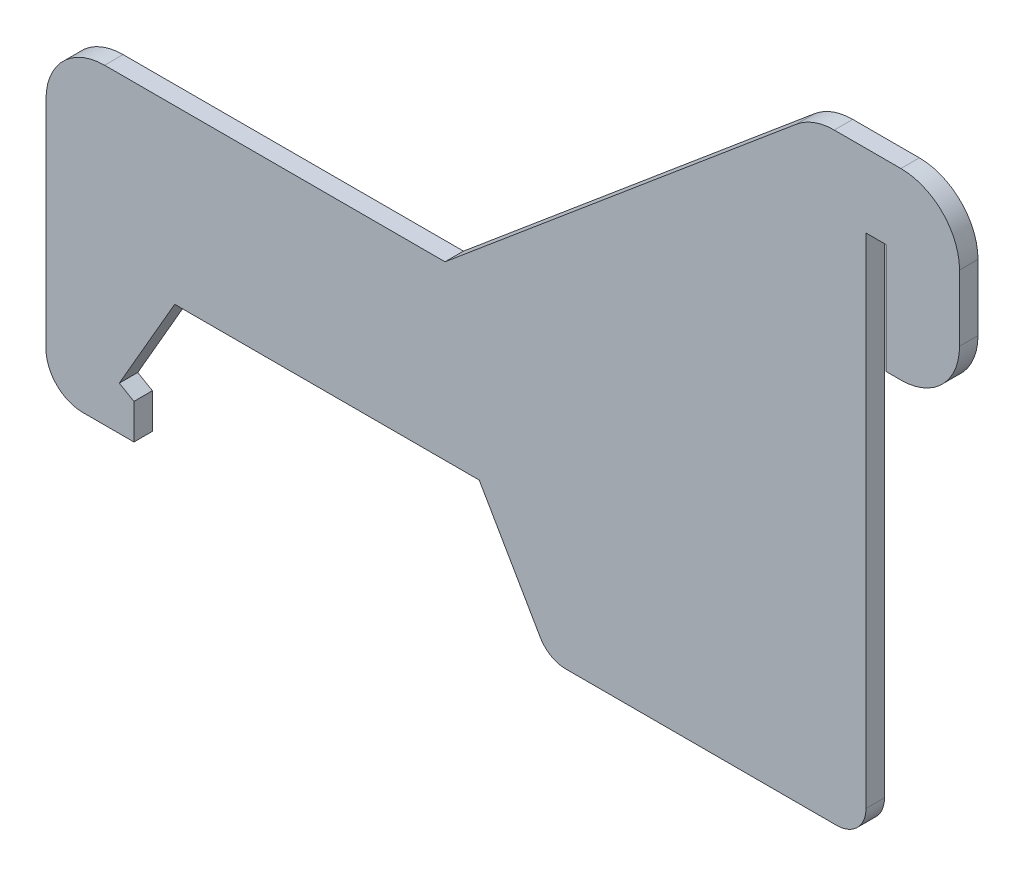
ISO-10303-21;
HEADER;
FILE_DESCRIPTION(('STEP AP214'),'2;1');
FILE_NAME('part.step','',(''),(''),'','','');
FILE_SCHEMA(('AUTOMOTIVE_DESIGN { 1 0 10303 214 1 1 1 1 }'));
ENDSEC;
DATA;
#1=APPLICATION_CONTEXT('core data for automotive mechanical design processes');
#2=APPLICATION_PROTOCOL_DEFINITION('international standard','automotive_design',2000,#1);
#3=PRODUCT_CONTEXT('',#1,'mechanical');
#4=PRODUCT('Part','Part','',(#3));
#5=PRODUCT_RELATED_PRODUCT_CATEGORY('part','',(#4));
#6=PRODUCT_DEFINITION_FORMATION('','',#4);
#7=PRODUCT_DEFINITION_CONTEXT('part definition',#1,'design');
#8=PRODUCT_DEFINITION('design','',#6,#7);
#9=PRODUCT_DEFINITION_SHAPE('','',#8);
#10=(LENGTH_UNIT() NAMED_UNIT(*) SI_UNIT(.MILLI.,.METRE.));
#11=(NAMED_UNIT(*) PLANE_ANGLE_UNIT() SI_UNIT($,.RADIAN.));
#12=(NAMED_UNIT(*) SI_UNIT($,.STERADIAN.) SOLID_ANGLE_UNIT());
#13=UNCERTAINTY_MEASURE_WITH_UNIT(LENGTH_MEASURE(1.E-05),#10,'distance_accuracy_value','');
#14=(GEOMETRIC_REPRESENTATION_CONTEXT(3) GLOBAL_UNCERTAINTY_ASSIGNED_CONTEXT((#13)) GLOBAL_UNIT_ASSIGNED_CONTEXT((#10,
#11,#12)) REPRESENTATION_CONTEXT('',''));
#15=CARTESIAN_POINT('',(0.,0.,0.));
#16=DIRECTION('',(0.,0.,1.));
#17=DIRECTION('',(1.,0.,0.));
#18=AXIS2_PLACEMENT_3D('',#15,#16,#17);
#19=CARTESIAN_POINT('',(21.9654534929176,10.4498181024498,0.8001));
#20=DIRECTION('',(0.,1.,0.));
#21=DIRECTION('',(-1.,0.,0.));
#22=AXIS2_PLACEMENT_3D('',#19,#20,#21);
#23=PLANE('',#22);
#24=DIRECTION('',(1.,0.,0.));
#25=VECTOR('',#24,1.);
#26=CARTESIAN_POINT('',(21.9654534929176,10.4498181024498,-0.8001));
#27=LINE('',#26,#25);
#28=CARTESIAN_POINT('',(-4.41849178405351,10.4498181024498,-0.8001));
#29=VERTEX_POINT('',#28);
#30=CARTESIAN_POINT('',(21.9654534929176,10.4498181024498,-0.8001));
#31=VERTEX_POINT('',#30);
#32=EDGE_CURVE('E217',#29,#31,#27,.T.);
#33=ORIENTED_EDGE('',*,*,#32,.T.);
#34=DIRECTION('',(0.,0.,-1.));
#35=VECTOR('',#34,1.);
#36=CARTESIAN_POINT('',(21.9654534929176,10.4498181024498,0.8001));
#37=LINE('',#36,#35);
#38=CARTESIAN_POINT('',(21.9654534929176,10.4498181024498,0.8001));
#39=VERTEX_POINT('',#38);
#40=EDGE_CURVE('E11',#39,#31,#37,.T.);
#41=ORIENTED_EDGE('',*,*,#40,.F.);
#42=DIRECTION('',(1.,0.,0.));
#43=VECTOR('',#42,1.);
#44=CARTESIAN_POINT('',(21.9654534929176,10.4498181024498,0.8001));
#45=LINE('',#44,#43);
#46=CARTESIAN_POINT('',(-4.41849178405351,10.4498181024498,0.8001));
#47=VERTEX_POINT('',#46);
#48=EDGE_CURVE('E261',#47,#39,#45,.T.);
#49=ORIENTED_EDGE('',*,*,#48,.F.);
#50=DIRECTION('',(0.,0.,-1.));
#51=VECTOR('',#50,1.);
#52=CARTESIAN_POINT('',(-4.41849178405351,10.4498181024498,0.8001));
#53=LINE('',#52,#51);
#54=EDGE_CURVE('E213',#47,#29,#53,.T.);
#55=ORIENTED_EDGE('',*,*,#54,.T.);
#56=EDGE_LOOP('',(#33,#41,#49,#55));
#57=FACE_BOUND('',#56,.T.);
#58=ADVANCED_FACE('F31',(#57),#23,.F.);
#59=CARTESIAN_POINT('',(27.2507592486414,1.29539999999989,0.8001));
#60=DIRECTION('',(0.866025403784438,0.5,0.));
#61=DIRECTION('',(-0.5,0.866025403784438,0.));
#62=AXIS2_PLACEMENT_3D('',#59,#60,#61);
#63=PLANE('',#62);
#64=DIRECTION('',(0.5,-0.866025403784438,0.));
#65=VECTOR('',#64,1.);
#66=CARTESIAN_POINT('',(27.2507592486414,1.29539999999989,-0.8001));
#67=LINE('',#66,#65);
#68=CARTESIAN_POINT('',(27.2507592486414,1.29539999999989,-0.8001));
#69=VERTEX_POINT('',#68);
#70=EDGE_CURVE('E220',#31,#69,#67,.T.);
#71=ORIENTED_EDGE('',*,*,#70,.T.);
#72=DIRECTION('',(0.,0.,-1.));
#73=VECTOR('',#72,1.);
#74=CARTESIAN_POINT('',(27.2507592486414,1.29539999999989,0.8001));
#75=LINE('',#74,#73);
#76=CARTESIAN_POINT('',(27.2507592486414,1.29539999999989,0.8001));
#77=VERTEX_POINT('',#76);
#78=EDGE_CURVE('E39',#77,#69,#75,.T.);
#79=ORIENTED_EDGE('',*,*,#78,.F.);
#80=DIRECTION('',(0.5,-0.866025403784438,0.));
#81=VECTOR('',#80,1.);
#82=CARTESIAN_POINT('',(27.2507592486414,1.29539999999989,0.8001));
#83=LINE('',#82,#81);
#84=EDGE_CURVE('E135',#39,#77,#83,.T.);
#85=ORIENTED_EDGE('',*,*,#84,.F.);
#86=ORIENTED_EDGE('',*,*,#40,.T.);
#87=EDGE_LOOP('',(#71,#79,#85,#86));
#88=FACE_BOUND('',#87,.T.);
#89=ADVANCED_FACE('F394',(#88),#63,.F.);
#90=CARTESIAN_POINT('',(29.4504637742539,2.56539999999989,0.8001));
#91=DIRECTION('',(0.,0.,-1.));
#92=DIRECTION('',(-1.,0.,0.));
#93=AXIS2_PLACEMENT_3D('',#90,#91,#92);
#94=CYLINDRICAL_SURFACE('',#93,2.54);
#95=CARTESIAN_POINT('',(29.4504637742539,2.56539999999989,-0.8001));
#96=DIRECTION('',(0.,0.,1.));
#97=DIRECTION('',(-1.,0.,0.));
#98=AXIS2_PLACEMENT_3D('',#95,#96,#97);
#99=CIRCLE('',#98,2.54);
#100=CARTESIAN_POINT('',(29.4504637742539,0.0253999999998938,-0.8001));
#101=VERTEX_POINT('',#100);
#102=EDGE_CURVE('E222',#69,#101,#99,.T.);
#103=ORIENTED_EDGE('',*,*,#102,.T.);
#104=DIRECTION('',(0.,0.,-1.));
#105=VECTOR('',#104,1.);
#106=CARTESIAN_POINT('',(29.4504637742539,0.0253999999998938,0.8001));
#107=LINE('',#106,#105);
#108=CARTESIAN_POINT('',(29.4504637742539,0.0253999999998938,0.8001));
#109=VERTEX_POINT('',#108);
#110=EDGE_CURVE('E313',#109,#101,#107,.T.);
#111=ORIENTED_EDGE('',*,*,#110,.F.);
#112=CARTESIAN_POINT('',(29.4504637742539,2.56539999999989,0.8001));
#113=DIRECTION('',(0.,0.,1.));
#114=DIRECTION('',(-1.,0.,0.));
#115=AXIS2_PLACEMENT_3D('',#112,#113,#114);
#116=CIRCLE('',#115,2.54);
#117=EDGE_CURVE('E321',#77,#109,#116,.T.);
#118=ORIENTED_EDGE('',*,*,#117,.F.);
#119=ORIENTED_EDGE('',*,*,#78,.T.);
#120=EDGE_LOOP('',(#103,#111,#118,#119));
#121=FACE_BOUND('',#120,.T.);
#122=ADVANCED_FACE('F319',(#121),#94,.T.);
#123=CARTESIAN_POINT('',(29.4504637742539,0.0253999999998917,0.8001));
#124=DIRECTION('',(0.,1.,0.));
#125=DIRECTION('',(0.,0.,1.));
#126=AXIS2_PLACEMENT_3D('',#123,#124,#125);
#127=PLANE('',#126);
#128=DIRECTION('',(1.,0.,0.));
#129=VECTOR('',#128,1.);
#130=CARTESIAN_POINT('',(29.4504637742539,0.0253999999998917,-0.8001));
#131=LINE('',#130,#129);
#132=CARTESIAN_POINT('',(52.9336,0.0253999999998917,-0.8001));
#133=VERTEX_POINT('',#132);
#134=EDGE_CURVE('E224',#101,#133,#131,.T.);
#135=ORIENTED_EDGE('',*,*,#134,.T.);
#136=DIRECTION('',(0.,0.,-1.));
#137=VECTOR('',#136,1.);
#138=CARTESIAN_POINT('',(52.9336,0.0253999999998917,0.8001));
#139=LINE('',#138,#137);
#140=CARTESIAN_POINT('',(52.9336,0.0253999999998917,0.8001));
#141=VERTEX_POINT('',#140);
#142=EDGE_CURVE('E310',#141,#133,#139,.T.);
#143=ORIENTED_EDGE('',*,*,#142,.F.);
#144=DIRECTION('',(1.,0.,0.));
#145=VECTOR('',#144,1.);
#146=CARTESIAN_POINT('',(29.4504637742539,0.0253999999998917,0.8001));
#147=LINE('',#146,#145);
#148=EDGE_CURVE('E339',#109,#141,#147,.T.);
#149=ORIENTED_EDGE('',*,*,#148,.F.);
#150=ORIENTED_EDGE('',*,*,#110,.T.);
#151=EDGE_LOOP('',(#135,#143,#149,#150));
#152=FACE_BOUND('',#151,.T.);
#153=ADVANCED_FACE('F330',(#152),#127,.F.);
#154=CARTESIAN_POINT('',(52.9336,2.56539999999989,0.8001));
#155=DIRECTION('',(0.,0.,-1.));
#156=DIRECTION('',(-1.,0.,0.));
#157=AXIS2_PLACEMENT_3D('',#154,#155,#156);
#158=CYLINDRICAL_SURFACE('',#157,2.54);
#159=CARTESIAN_POINT('',(52.9336,2.56539999999989,-0.8001));
#160=DIRECTION('',(0.,0.,1.));
#161=DIRECTION('',(-1.,0.,0.));
#162=AXIS2_PLACEMENT_3D('',#159,#160,#161);
#163=CIRCLE('',#162,2.54);
#164=CARTESIAN_POINT('',(55.4736,2.56539999999989,-0.8001));
#165=VERTEX_POINT('',#164);
#166=EDGE_CURVE('E226',#133,#165,#163,.T.);
#167=ORIENTED_EDGE('',*,*,#166,.T.);
#168=DIRECTION('',(0.,0.,-1.));
#169=VECTOR('',#168,1.);
#170=CARTESIAN_POINT('',(55.4736,2.56539999999989,0.8001));
#171=LINE('',#170,#169);
#172=CARTESIAN_POINT('',(55.4736,2.56539999999989,0.8001));
#173=VERTEX_POINT('',#172);
#174=EDGE_CURVE('E307',#173,#165,#171,.T.);
#175=ORIENTED_EDGE('',*,*,#174,.F.);
#176=CARTESIAN_POINT('',(52.9336,2.56539999999989,0.8001));
#177=DIRECTION('',(0.,0.,1.));
#178=DIRECTION('',(-1.,0.,0.));
#179=AXIS2_PLACEMENT_3D('',#176,#177,#178);
#180=CIRCLE('',#179,2.54);
#181=EDGE_CURVE('E336',#141,#173,#180,.T.);
#182=ORIENTED_EDGE('',*,*,#181,.F.);
#183=ORIENTED_EDGE('',*,*,#142,.T.);
#184=EDGE_LOOP('',(#167,#175,#182,#183));
#185=FACE_BOUND('',#184,.T.);
#186=ADVANCED_FACE('F334',(#185),#158,.T.);
#187=CARTESIAN_POINT('',(55.4736,45.7453999999999,0.8001));
#188=DIRECTION('',(-1.,0.,0.));
#189=DIRECTION('',(0.,0.,1.));
#190=AXIS2_PLACEMENT_3D('',#187,#188,#189);
#191=PLANE('',#190);
#192=DIRECTION('',(0.,1.,0.));
#193=VECTOR('',#192,1.);
#194=CARTESIAN_POINT('',(55.4736,45.7453999999999,-0.8001));
#195=LINE('',#194,#193);
#196=CARTESIAN_POINT('',(55.4736,45.7453999999999,-0.8001));
#197=VERTEX_POINT('',#196);
#198=EDGE_CURVE('E228',#165,#197,#195,.T.);
#199=ORIENTED_EDGE('',*,*,#198,.T.);
#200=DIRECTION('',(0.,0.,-1.));
#201=VECTOR('',#200,1.);
#202=CARTESIAN_POINT('',(55.4736,45.7453999999999,0.8001));
#203=LINE('',#202,#201);
#204=CARTESIAN_POINT('',(55.4736,45.7453999999999,0.8001));
#205=VERTEX_POINT('',#204);
#206=EDGE_CURVE('E304',#205,#197,#203,.T.);
#207=ORIENTED_EDGE('',*,*,#206,.F.);
#208=DIRECTION('',(0.,1.,0.));
#209=VECTOR('',#208,1.);
#210=CARTESIAN_POINT('',(55.4736,45.7453999999999,0.8001));
#211=LINE('',#210,#209);
#212=EDGE_CURVE('E338',#173,#205,#211,.T.);
#213=ORIENTED_EDGE('',*,*,#212,.F.);
#214=ORIENTED_EDGE('',*,*,#174,.T.);
#215=EDGE_LOOP('',(#199,#207,#213,#214));
#216=FACE_BOUND('',#215,.T.);
#217=ADVANCED_FACE('F407',(#216),#191,.F.);
#218=CARTESIAN_POINT('',(57.2262,45.7453999999999,0.8001));
#219=DIRECTION('',(0.,1.,0.));
#220=DIRECTION('',(0.,0.,1.));
#221=AXIS2_PLACEMENT_3D('',#218,#219,#220);
#222=PLANE('',#221);
#223=DIRECTION('',(1.,0.,0.));
#224=VECTOR('',#223,1.);
#225=CARTESIAN_POINT('',(57.2262,45.7453999999999,-0.8001));
#226=LINE('',#225,#224);
#227=CARTESIAN_POINT('',(57.2262,45.7453999999999,-0.8001));
#228=VERTEX_POINT('',#227);
#229=EDGE_CURVE('E230',#197,#228,#226,.T.);
#230=ORIENTED_EDGE('',*,*,#229,.T.);
#231=DIRECTION('',(0.,0.,-1.));
#232=VECTOR('',#231,1.);
#233=CARTESIAN_POINT('',(57.2262,45.7453999999999,0.8001));
#234=LINE('',#233,#232);
#235=CARTESIAN_POINT('',(57.2262,45.7453999999999,0.8001));
#236=VERTEX_POINT('',#235);
#237=EDGE_CURVE('E301',#236,#228,#234,.T.);
#238=ORIENTED_EDGE('',*,*,#237,.F.);
#239=DIRECTION('',(1.,0.,0.));
#240=VECTOR('',#239,1.);
#241=CARTESIAN_POINT('',(57.2262,45.7453999999999,0.8001));
#242=LINE('',#241,#240);
#243=EDGE_CURVE('E341',#205,#236,#242,.T.);
#244=ORIENTED_EDGE('',*,*,#243,.F.);
#245=ORIENTED_EDGE('',*,*,#206,.T.);
#246=EDGE_LOOP('',(#230,#238,#244,#245));
#247=FACE_BOUND('',#246,.T.);
#248=ADVANCED_FACE('F410',(#247),#222,.F.);
#249=CARTESIAN_POINT('',(57.2262,36.2203999999999,0.8001));
#250=DIRECTION('',(1.,0.,0.));
#251=DIRECTION('',(0.,1.,0.));
#252=AXIS2_PLACEMENT_3D('',#249,#250,#251);
#253=PLANE('',#252);
#254=DIRECTION('',(0.,-1.,0.));
#255=VECTOR('',#254,1.);
#256=CARTESIAN_POINT('',(57.2262,36.2203999999999,-0.8001));
#257=LINE('',#256,#255);
#258=CARTESIAN_POINT('',(57.2262,36.2203999999999,-0.8001));
#259=VERTEX_POINT('',#258);
#260=EDGE_CURVE('E232',#228,#259,#257,.T.);
#261=ORIENTED_EDGE('',*,*,#260,.T.);
#262=DIRECTION('',(0.,0.,-1.));
#263=VECTOR('',#262,1.);
#264=CARTESIAN_POINT('',(57.2262,36.2203999999999,0.8001));
#265=LINE('',#264,#263);
#266=CARTESIAN_POINT('',(57.2262,36.2203999999999,0.8001));
#267=VERTEX_POINT('',#266);
#268=EDGE_CURVE('E298',#267,#259,#265,.T.);
#269=ORIENTED_EDGE('',*,*,#268,.F.);
#270=DIRECTION('',(0.,-1.,0.));
#271=VECTOR('',#270,1.);
#272=CARTESIAN_POINT('',(57.2262,36.2203999999999,0.8001));
#273=LINE('',#272,#271);
#274=EDGE_CURVE('E347',#236,#267,#273,.T.);
#275=ORIENTED_EDGE('',*,*,#274,.F.);
#276=ORIENTED_EDGE('',*,*,#237,.T.);
#277=EDGE_LOOP('',(#261,#269,#275,#276));
#278=FACE_BOUND('',#277,.T.);
#279=ADVANCED_FACE('F414',(#278),#253,.F.);
#280=CARTESIAN_POINT('',(58.4962,36.2203999999999,0.8001));
#281=DIRECTION('',(0.,1.,0.));
#282=DIRECTION('',(0.,0.,1.));
#283=AXIS2_PLACEMENT_3D('',#280,#281,#282);
#284=PLANE('',#283);
#285=DIRECTION('',(1.,0.,0.));
#286=VECTOR('',#285,1.);
#287=CARTESIAN_POINT('',(58.4962,36.2203999999999,-0.8001));
#288=LINE('',#287,#286);
#289=CARTESIAN_POINT('',(58.4962,36.2203999999999,-0.8001));
#290=VERTEX_POINT('',#289);
#291=EDGE_CURVE('E234',#259,#290,#288,.T.);
#292=ORIENTED_EDGE('',*,*,#291,.T.);
#293=DIRECTION('',(0.,0.,-1.));
#294=VECTOR('',#293,1.);
#295=CARTESIAN_POINT('',(58.4962,36.2203999999999,0.8001));
#296=LINE('',#295,#294);
#297=CARTESIAN_POINT('',(58.4962,36.2203999999999,0.8001));
#298=VERTEX_POINT('',#297);
#299=EDGE_CURVE('E295',#298,#290,#296,.T.);
#300=ORIENTED_EDGE('',*,*,#299,.F.);
#301=DIRECTION('',(1.,0.,0.));
#302=VECTOR('',#301,1.);
#303=CARTESIAN_POINT('',(58.4962,36.2203999999999,0.8001));
#304=LINE('',#303,#302);
#305=EDGE_CURVE('E349',#267,#298,#304,.T.);
#306=ORIENTED_EDGE('',*,*,#305,.F.);
#307=ORIENTED_EDGE('',*,*,#268,.T.);
#308=EDGE_LOOP('',(#292,#300,#306,#307));
#309=FACE_BOUND('',#308,.T.);
#310=ADVANCED_FACE('F418',(#309),#284,.F.);
#311=CARTESIAN_POINT('',(58.4962,41.3003999999999,0.8001));
#312=DIRECTION('',(0.,0.,-1.));
#313=DIRECTION('',(-1.,0.,0.));
#314=AXIS2_PLACEMENT_3D('',#311,#312,#313);
#315=CYLINDRICAL_SURFACE('',#314,5.07999999999999);
#316=CARTESIAN_POINT('',(58.4962,41.3003999999999,-0.8001));
#317=DIRECTION('',(0.,0.,1.));
#318=DIRECTION('',(-1.,0.,0.));
#319=AXIS2_PLACEMENT_3D('',#316,#317,#318);
#320=CIRCLE('',#319,5.07999999999999);
#321=CARTESIAN_POINT('',(63.5762,41.3003999999999,-0.8001));
#322=VERTEX_POINT('',#321);
#323=EDGE_CURVE('E236',#290,#322,#320,.T.);
#324=ORIENTED_EDGE('',*,*,#323,.T.);
#325=DIRECTION('',(0.,0.,-1.));
#326=VECTOR('',#325,1.);
#327=CARTESIAN_POINT('',(63.5762,41.3003999999999,0.8001));
#328=LINE('',#327,#326);
#329=CARTESIAN_POINT('',(63.5762,41.3003999999999,0.8001));
#330=VERTEX_POINT('',#329);
#331=EDGE_CURVE('E292',#330,#322,#328,.T.);
#332=ORIENTED_EDGE('',*,*,#331,.F.);
#333=CARTESIAN_POINT('',(58.4962,41.3003999999999,0.8001));
#334=DIRECTION('',(0.,0.,1.));
#335=DIRECTION('',(-1.,0.,0.));
#336=AXIS2_PLACEMENT_3D('',#333,#334,#335);
#337=CIRCLE('',#336,5.07999999999999);
#338=EDGE_CURVE('E351',#298,#330,#337,.T.);
#339=ORIENTED_EDGE('',*,*,#338,.F.);
#340=ORIENTED_EDGE('',*,*,#299,.T.);
#341=EDGE_LOOP('',(#324,#332,#339,#340));
#342=FACE_BOUND('',#341,.T.);
#343=ADVANCED_FACE('F422',(#342),#315,.T.);
#344=CARTESIAN_POINT('',(63.5762,47.0153999999999,0.8001));
#345=DIRECTION('',(-1.,0.,0.));
#346=DIRECTION('',(0.,-1.,0.));
#347=AXIS2_PLACEMENT_3D('',#344,#345,#346);
#348=PLANE('',#347);
#349=DIRECTION('',(0.,1.,0.));
#350=VECTOR('',#349,1.);
#351=CARTESIAN_POINT('',(63.5762,47.0153999999999,-0.8001));
#352=LINE('',#351,#350);
#353=CARTESIAN_POINT('',(63.5762,47.0153999999999,-0.8001));
#354=VERTEX_POINT('',#353);
#355=EDGE_CURVE('E238',#322,#354,#352,.T.);
#356=ORIENTED_EDGE('',*,*,#355,.T.);
#357=DIRECTION('',(0.,0.,-1.));
#358=VECTOR('',#357,1.);
#359=CARTESIAN_POINT('',(63.5762,47.0153999999999,0.8001));
#360=LINE('',#359,#358);
#361=CARTESIAN_POINT('',(63.5762,47.0153999999999,0.8001));
#362=VERTEX_POINT('',#361);
#363=EDGE_CURVE('E289',#362,#354,#360,.T.);
#364=ORIENTED_EDGE('',*,*,#363,.F.);
#365=DIRECTION('',(0.,1.,0.));
#366=VECTOR('',#365,1.);
#367=CARTESIAN_POINT('',(63.5762,47.0153999999999,0.8001));
#368=LINE('',#367,#366);
#369=EDGE_CURVE('E353',#330,#362,#368,.T.);
#370=ORIENTED_EDGE('',*,*,#369,.F.);
#371=ORIENTED_EDGE('',*,*,#331,.T.);
#372=EDGE_LOOP('',(#356,#364,#370,#371));
#373=FACE_BOUND('',#372,.T.);
#374=ADVANCED_FACE('F426',(#373),#348,.F.);
#375=CARTESIAN_POINT('',(58.4962,47.0153999999999,0.8001));
#376=DIRECTION('',(0.,0.,-1.));
#377=DIRECTION('',(-1.,0.,0.));
#378=AXIS2_PLACEMENT_3D('',#375,#376,#377);
#379=CYLINDRICAL_SURFACE('',#378,5.08);
#380=CARTESIAN_POINT('',(58.4962,47.0153999999999,-0.8001));
#381=DIRECTION('',(0.,0.,1.));
#382=DIRECTION('',(-1.,0.,0.));
#383=AXIS2_PLACEMENT_3D('',#380,#381,#382);
#384=CIRCLE('',#383,5.08);
#385=CARTESIAN_POINT('',(58.4962,52.0953999999999,-0.8001));
#386=VERTEX_POINT('',#385);
#387=EDGE_CURVE('E240',#354,#386,#384,.T.);
#388=ORIENTED_EDGE('',*,*,#387,.T.);
#389=DIRECTION('',(0.,0.,-1.));
#390=VECTOR('',#389,1.);
#391=CARTESIAN_POINT('',(58.4962,52.0953999999999,0.8001));
#392=LINE('',#391,#390);
#393=CARTESIAN_POINT('',(58.4962,52.0953999999999,0.8001));
#394=VERTEX_POINT('',#393);
#395=EDGE_CURVE('E286',#394,#386,#392,.T.);
#396=ORIENTED_EDGE('',*,*,#395,.F.);
#397=CARTESIAN_POINT('',(58.4962,47.0153999999999,0.8001));
#398=DIRECTION('',(0.,0.,1.));
#399=DIRECTION('',(-1.,0.,0.));
#400=AXIS2_PLACEMENT_3D('',#397,#398,#399);
#401=CIRCLE('',#400,5.08);
#402=EDGE_CURVE('E355',#362,#394,#401,.T.);
#403=ORIENTED_EDGE('',*,*,#402,.F.);
#404=ORIENTED_EDGE('',*,*,#363,.T.);
#405=EDGE_LOOP('',(#388,#396,#403,#404));
#406=FACE_BOUND('',#405,.T.);
#407=ADVANCED_FACE('F430',(#406),#379,.T.);
#408=CARTESIAN_POINT('',(52.7251687900723,52.0953999999999,0.8001));
#409=DIRECTION('',(0.,-1.,0.));
#410=DIRECTION('',(1.,0.,0.));
#411=AXIS2_PLACEMENT_3D('',#408,#409,#410);
#412=PLANE('',#411);
#413=DIRECTION('',(-1.,0.,0.));
#414=VECTOR('',#413,1.);
#415=CARTESIAN_POINT('',(52.7251687900723,52.0953999999999,-0.8001));
#416=LINE('',#415,#414);
#417=CARTESIAN_POINT('',(52.7251687900723,52.0953999999999,-0.8001));
#418=VERTEX_POINT('',#417);
#419=EDGE_CURVE('E242',#386,#418,#416,.T.);
#420=ORIENTED_EDGE('',*,*,#419,.T.);
#421=DIRECTION('',(0.,0.,-1.));
#422=VECTOR('',#421,1.);
#423=CARTESIAN_POINT('',(52.7251687900723,52.0953999999999,0.8001));
#424=LINE('',#423,#422);
#425=CARTESIAN_POINT('',(52.7251687900723,52.0953999999999,0.8001));
#426=VERTEX_POINT('',#425);
#427=EDGE_CURVE('E283',#426,#418,#424,.T.);
#428=ORIENTED_EDGE('',*,*,#427,.F.);
#429=DIRECTION('',(-1.,0.,0.));
#430=VECTOR('',#429,1.);
#431=CARTESIAN_POINT('',(52.7251687900723,52.0953999999999,0.8001));
#432=LINE('',#431,#430);
#433=EDGE_CURVE('E357',#394,#426,#432,.T.);
#434=ORIENTED_EDGE('',*,*,#433,.F.);
#435=ORIENTED_EDGE('',*,*,#395,.T.);
#436=EDGE_LOOP('',(#420,#428,#434,#435));
#437=FACE_BOUND('',#436,.T.);
#438=ADVANCED_FACE('F434',(#437),#412,.F.);
#439=CARTESIAN_POINT('',(52.7251687900723,47.0153999999999,0.8001));
#440=DIRECTION('',(0.,0.,-1.));
#441=DIRECTION('',(-1.,0.,0.));
#442=AXIS2_PLACEMENT_3D('',#439,#440,#441);
#443=CYLINDRICAL_SURFACE('',#442,5.08);
#444=CARTESIAN_POINT('',(52.7251687900723,47.0153999999999,-0.8001));
#445=DIRECTION('',(0.,0.,1.));
#446=DIRECTION('',(-1.,0.,0.));
#447=AXIS2_PLACEMENT_3D('',#444,#445,#446);
#448=CIRCLE('',#447,5.08);
#449=CARTESIAN_POINT('',(49.4598077328647,50.9069057710443,-0.8001));
#450=VERTEX_POINT('',#449);
#451=EDGE_CURVE('E244',#418,#450,#448,.T.);
#452=ORIENTED_EDGE('',*,*,#451,.T.);
#453=DIRECTION('',(0.,0.,-1.));
#454=VECTOR('',#453,1.);
#455=CARTESIAN_POINT('',(49.4598077328647,50.9069057710443,0.8001));
#456=LINE('',#455,#454);
#457=CARTESIAN_POINT('',(49.4598077328647,50.9069057710443,0.8001));
#458=VERTEX_POINT('',#457);
#459=EDGE_CURVE('E280',#458,#450,#456,.T.);
#460=ORIENTED_EDGE('',*,*,#459,.F.);
#461=CARTESIAN_POINT('',(52.7251687900723,47.0153999999999,0.8001));
#462=DIRECTION('',(0.,0.,1.));
#463=DIRECTION('',(-1.,0.,0.));
#464=AXIS2_PLACEMENT_3D('',#461,#462,#463);
#465=CIRCLE('',#464,5.08);
#466=EDGE_CURVE('E359',#426,#458,#465,.T.);
#467=ORIENTED_EDGE('',*,*,#466,.F.);
#468=ORIENTED_EDGE('',*,*,#427,.T.);
#469=EDGE_LOOP('',(#452,#460,#467,#468));
#470=FACE_BOUND('',#469,.T.);
#471=ADVANCED_FACE('F438',(#470),#443,.T.);
#472=CARTESIAN_POINT('',(19.0013200617568,25.3491999999999,0.8001));
#473=DIRECTION('',(0.642787609686541,-0.766044443118977,0.));
#474=DIRECTION('',(0.766044443118977,0.642787609686541,0.));
#475=AXIS2_PLACEMENT_3D('',#472,#473,#474);
#476=PLANE('',#475);
#477=DIRECTION('',(-0.766044443118977,-0.64278760968654,0.));
#478=VECTOR('',#477,1.);
#479=CARTESIAN_POINT('',(19.0013200617568,25.3491999999999,-0.8001));
#480=LINE('',#479,#478);
#481=CARTESIAN_POINT('',(19.0013200617568,25.3491999999999,-0.8001));
#482=VERTEX_POINT('',#481);
#483=EDGE_CURVE('E246',#450,#482,#480,.T.);
#484=ORIENTED_EDGE('',*,*,#483,.T.);
#485=DIRECTION('',(0.,0.,-1.));
#486=VECTOR('',#485,1.);
#487=CARTESIAN_POINT('',(19.0013200617568,25.3491999999999,0.8001));
#488=LINE('',#487,#486);
#489=CARTESIAN_POINT('',(19.0013200617568,25.3491999999999,0.8001));
#490=VERTEX_POINT('',#489);
#491=EDGE_CURVE('E277',#490,#482,#488,.T.);
#492=ORIENTED_EDGE('',*,*,#491,.F.);
#493=DIRECTION('',(-0.766044443118977,-0.64278760968654,0.));
#494=VECTOR('',#493,1.);
#495=CARTESIAN_POINT('',(19.0013200617568,25.3491999999999,0.8001));
#496=LINE('',#495,#494);
#497=EDGE_CURVE('E361',#458,#490,#496,.T.);
#498=ORIENTED_EDGE('',*,*,#497,.F.);
#499=ORIENTED_EDGE('',*,*,#459,.T.);
#500=EDGE_LOOP('',(#484,#492,#498,#499));
#501=FACE_BOUND('',#500,.T.);
#502=ADVANCED_FACE('F442',(#501),#476,.F.);
#503=CARTESIAN_POINT('',(-10.4904267796882,25.3491999999999,0.8001));
#504=DIRECTION('',(0.,-1.,0.));
#505=DIRECTION('',(0.,0.,-1.));
#506=AXIS2_PLACEMENT_3D('',#503,#504,#505);
#507=PLANE('',#506);
#508=DIRECTION('',(-1.,0.,0.));
#509=VECTOR('',#508,1.);
#510=CARTESIAN_POINT('',(-10.4904267796882,25.3491999999999,-0.8001));
#511=LINE('',#510,#509);
#512=CARTESIAN_POINT('',(-10.4904267796882,25.3491999999999,-0.8001));
#513=VERTEX_POINT('',#512);
#514=EDGE_CURVE('E248',#482,#513,#511,.T.);
#515=ORIENTED_EDGE('',*,*,#514,.T.);
#516=DIRECTION('',(0.,0.,-1.));
#517=VECTOR('',#516,1.);
#518=CARTESIAN_POINT('',(-10.4904267796882,25.3491999999999,0.8001));
#519=LINE('',#518,#517);
#520=CARTESIAN_POINT('',(-10.4904267796882,25.3491999999999,0.8001));
#521=VERTEX_POINT('',#520);
#522=EDGE_CURVE('E274',#521,#513,#519,.T.);
#523=ORIENTED_EDGE('',*,*,#522,.F.);
#524=DIRECTION('',(-1.,0.,0.));
#525=VECTOR('',#524,1.);
#526=CARTESIAN_POINT('',(-10.4904267796882,25.3491999999999,0.8001));
#527=LINE('',#526,#525);
#528=EDGE_CURVE('E363',#490,#521,#527,.T.);
#529=ORIENTED_EDGE('',*,*,#528,.F.);
#530=ORIENTED_EDGE('',*,*,#491,.T.);
#531=EDGE_LOOP('',(#515,#523,#529,#530));
#532=FACE_BOUND('',#531,.T.);
#533=ADVANCED_FACE('F446',(#532),#507,.F.);
#534=CARTESIAN_POINT('',(-10.4904267796882,20.2691999999999,0.8001));
#535=DIRECTION('',(0.,0.,-1.));
#536=DIRECTION('',(-1.,0.,0.));
#537=AXIS2_PLACEMENT_3D('',#534,#535,#536);
#538=CYLINDRICAL_SURFACE('',#537,5.08);
#539=CARTESIAN_POINT('',(-10.4904267796882,20.2691999999999,-0.8001));
#540=DIRECTION('',(0.,0.,1.));
#541=DIRECTION('',(-1.,0.,0.));
#542=AXIS2_PLACEMENT_3D('',#539,#540,#541);
#543=CIRCLE('',#542,5.08);
#544=CARTESIAN_POINT('',(-15.5704267796882,20.2691999999999,-0.8001));
#545=VERTEX_POINT('',#544);
#546=EDGE_CURVE('E250',#513,#545,#543,.T.);
#547=ORIENTED_EDGE('',*,*,#546,.T.);
#548=DIRECTION('',(0.,0.,-1.));
#549=VECTOR('',#548,1.);
#550=CARTESIAN_POINT('',(-15.5704267796882,20.2691999999999,0.8001));
#551=LINE('',#550,#549);
#552=CARTESIAN_POINT('',(-15.5704267796882,20.2691999999999,0.8001));
#553=VERTEX_POINT('',#552);
#554=EDGE_CURVE('E271',#553,#545,#551,.T.);
#555=ORIENTED_EDGE('',*,*,#554,.F.);
#556=CARTESIAN_POINT('',(-10.4904267796882,20.2691999999999,0.8001));
#557=DIRECTION('',(0.,0.,1.));
#558=DIRECTION('',(-1.,0.,0.));
#559=AXIS2_PLACEMENT_3D('',#556,#557,#558);
#560=CIRCLE('',#559,5.08);
#561=EDGE_CURVE('E365',#521,#553,#560,.T.);
#562=ORIENTED_EDGE('',*,*,#561,.F.);
#563=ORIENTED_EDGE('',*,*,#522,.T.);
#564=EDGE_LOOP('',(#547,#555,#562,#563));
#565=FACE_BOUND('',#564,.T.);
#566=ADVANCED_FACE('F450',(#565),#538,.T.);
#567=CARTESIAN_POINT('',(-15.5704267796882,1.52400000000093,0.8001));
#568=DIRECTION('',(1.,0.,0.));
#569=DIRECTION('',(0.,0.,-1.));
#570=AXIS2_PLACEMENT_3D('',#567,#568,#569);
#571=PLANE('',#570);
#572=DIRECTION('',(0.,-1.,0.));
#573=VECTOR('',#572,1.);
#574=CARTESIAN_POINT('',(-15.5704267796882,1.52400000000093,-0.8001));
#575=LINE('',#574,#573);
#576=CARTESIAN_POINT('',(-15.5704267796882,1.52400000000093,-0.8001));
#577=VERTEX_POINT('',#576);
#578=EDGE_CURVE('E252',#545,#577,#575,.T.);
#579=ORIENTED_EDGE('',*,*,#578,.T.);
#580=DIRECTION('',(0.,0.,-1.));
#581=VECTOR('',#580,1.);
#582=CARTESIAN_POINT('',(-15.5704267796882,1.52400000000093,0.8001));
#583=LINE('',#582,#581);
#584=CARTESIAN_POINT('',(-15.5704267796882,1.52400000000093,0.8001));
#585=VERTEX_POINT('',#584);
#586=EDGE_CURVE('E268',#585,#577,#583,.T.);
#587=ORIENTED_EDGE('',*,*,#586,.F.);
#588=DIRECTION('',(0.,-1.,0.));
#589=VECTOR('',#588,1.);
#590=CARTESIAN_POINT('',(-15.5704267796882,1.52400000000093,0.8001));
#591=LINE('',#590,#589);
#592=EDGE_CURVE('E367',#553,#585,#591,.T.);
#593=ORIENTED_EDGE('',*,*,#592,.F.);
#594=ORIENTED_EDGE('',*,*,#554,.T.);
#595=EDGE_LOOP('',(#579,#587,#593,#594));
#596=FACE_BOUND('',#595,.T.);
#597=ADVANCED_FACE('F454',(#596),#571,.F.);
#598=CARTESIAN_POINT('',(-12.3954267796882,1.52400000000093,0.8001));
#599=DIRECTION('',(0.,0.,-1.));
#600=DIRECTION('',(-1.,0.,0.));
#601=AXIS2_PLACEMENT_3D('',#598,#599,#600);
#602=CYLINDRICAL_SURFACE('',#601,3.175);
#603=CARTESIAN_POINT('',(-12.3954267796882,1.52400000000093,-0.8001));
#604=DIRECTION('',(0.,0.,1.));
#605=DIRECTION('',(-1.,0.,0.));
#606=AXIS2_PLACEMENT_3D('',#603,#604,#605);
#607=CIRCLE('',#606,3.175);
#608=CARTESIAN_POINT('',(-12.3954267796882,-1.65099999999907,-0.8001));
#609=VERTEX_POINT('',#608);
#610=EDGE_CURVE('E254',#577,#609,#607,.T.);
#611=ORIENTED_EDGE('',*,*,#610,.T.);
#612=DIRECTION('',(0.,0.,-1.));
#613=VECTOR('',#612,1.);
#614=CARTESIAN_POINT('',(-12.3954267796882,-1.65099999999907,0.8001));
#615=LINE('',#614,#613);
#616=CARTESIAN_POINT('',(-12.3954267796882,-1.65099999999907,0.8001));
#617=VERTEX_POINT('',#616);
#618=EDGE_CURVE('E265',#617,#609,#615,.T.);
#619=ORIENTED_EDGE('',*,*,#618,.F.);
#620=CARTESIAN_POINT('',(-12.3954267796882,1.52400000000093,0.8001));
#621=DIRECTION('',(0.,0.,1.));
#622=DIRECTION('',(-1.,0.,0.));
#623=AXIS2_PLACEMENT_3D('',#620,#621,#622);
#624=CIRCLE('',#623,3.175);
#625=EDGE_CURVE('E369',#585,#617,#624,.T.);
#626=ORIENTED_EDGE('',*,*,#625,.F.);
#627=ORIENTED_EDGE('',*,*,#586,.T.);
#628=EDGE_LOOP('',(#611,#619,#626,#627));
#629=FACE_BOUND('',#628,.T.);
#630=ADVANCED_FACE('F375',(#629),#602,.T.);
#631=CARTESIAN_POINT('',(-7.95042677968824,-1.65099999999907,0.8001));
#632=DIRECTION('',(0.,1.,0.));
#633=DIRECTION('',(-1.,0.,0.));
#634=AXIS2_PLACEMENT_3D('',#631,#632,#633);
#635=PLANE('',#634);
#636=DIRECTION('',(1.,0.,0.));
#637=VECTOR('',#636,1.);
#638=CARTESIAN_POINT('',(-7.95042677968824,-1.65099999999907,-0.8001));
#639=LINE('',#638,#637);
#640=CARTESIAN_POINT('',(-7.95042677968824,-1.65099999999907,-0.8001));
#641=VERTEX_POINT('',#640);
#642=EDGE_CURVE('E256',#609,#641,#639,.T.);
#643=ORIENTED_EDGE('',*,*,#642,.T.);
#644=DIRECTION('',(0.,0.,-1.));
#645=VECTOR('',#644,1.);
#646=CARTESIAN_POINT('',(-7.95042677968824,-1.65099999999907,0.8001));
#647=LINE('',#646,#645);
#648=CARTESIAN_POINT('',(-7.95042677968824,-1.65099999999907,0.8001));
#649=VERTEX_POINT('',#648);
#650=EDGE_CURVE('E208',#649,#641,#647,.T.);
#651=ORIENTED_EDGE('',*,*,#650,.F.);
#652=DIRECTION('',(1.,0.,0.));
#653=VECTOR('',#652,1.);
#654=CARTESIAN_POINT('',(-7.95042677968824,-1.65099999999907,0.8001));
#655=LINE('',#654,#653);
#656=EDGE_CURVE('E199',#617,#649,#655,.T.);
#657=ORIENTED_EDGE('',*,*,#656,.F.);
#658=ORIENTED_EDGE('',*,*,#618,.T.);
#659=EDGE_LOOP('',(#643,#651,#657,#658));
#660=FACE_BOUND('',#659,.T.);
#661=ADVANCED_FACE('F379',(#660),#635,.F.);
#662=CARTESIAN_POINT('',(-7.95042677968824,-1.65099999999907,0.8001));
#663=DIRECTION('',(-1.,0.,0.));
#664=DIRECTION('',(0.,0.,1.));
#665=AXIS2_PLACEMENT_3D('',#662,#663,#664);
#666=PLANE('',#665);
#667=DIRECTION('',(0.,1.,0.));
#668=VECTOR('',#667,1.);
#669=CARTESIAN_POINT('',(-7.95042677968824,-1.65099999999907,-0.8001));
#670=LINE('',#669,#668);
#671=CARTESIAN_POINT('',(-7.95042677968824,1.39938787349655,-0.8001));
#672=VERTEX_POINT('',#671);
#673=EDGE_CURVE('E207',#641,#672,#670,.T.);
#674=ORIENTED_EDGE('',*,*,#673,.T.);
#675=DIRECTION('',(0.,0.,-1.));
#676=VECTOR('',#675,1.);
#677=CARTESIAN_POINT('',(-7.95042677968824,1.39938787349655,0.8001));
#678=LINE('',#677,#676);
#679=CARTESIAN_POINT('',(-7.95042677968824,1.39938787349655,0.8001));
#680=VERTEX_POINT('',#679);
#681=EDGE_CURVE('E204',#680,#672,#678,.T.);
#682=ORIENTED_EDGE('',*,*,#681,.F.);
#683=DIRECTION('',(0.,1.,0.));
#684=VECTOR('',#683,1.);
#685=CARTESIAN_POINT('',(-7.95042677968824,-1.65099999999907,0.8001));
#686=LINE('',#685,#684);
#687=EDGE_CURVE('E193',#649,#680,#686,.T.);
#688=ORIENTED_EDGE('',*,*,#687,.F.);
#689=ORIENTED_EDGE('',*,*,#650,.T.);
#690=EDGE_LOOP('',(#674,#682,#688,#689));
#691=FACE_BOUND('',#690,.T.);
#692=ADVANCED_FACE('F205',(#691),#666,.F.);
#693=CARTESIAN_POINT('',(-7.95042677968824,1.39938787349655,0.8001));
#694=DIRECTION('',(-0.5,-0.866025403784439,0.));
#695=DIRECTION('',(0.866025403784439,-0.5,0.));
#696=AXIS2_PLACEMENT_3D('',#693,#694,#695);
#697=PLANE('',#696);
#698=DIRECTION('',(-0.866025403784439,0.5,0.));
#699=VECTOR('',#698,1.);
#700=CARTESIAN_POINT('',(-7.95042677968824,1.39938787349655,-0.8001));
#701=LINE('',#700,#699);
#702=CARTESIAN_POINT('',(-9.22042677968824,2.13262271536738,-0.8001));
#703=VERTEX_POINT('',#702);
#704=EDGE_CURVE('E121',#672,#703,#701,.T.);
#705=ORIENTED_EDGE('',*,*,#704,.T.);
#706=DIRECTION('',(0.,0.,-1.));
#707=VECTOR('',#706,1.);
#708=CARTESIAN_POINT('',(-9.22042677968824,2.13262271536738,0.8001));
#709=LINE('',#708,#707);
#710=CARTESIAN_POINT('',(-9.22042677968824,2.13262271536738,0.8001));
#711=VERTEX_POINT('',#710);
#712=EDGE_CURVE('E209',#711,#703,#709,.T.);
#713=ORIENTED_EDGE('',*,*,#712,.F.);
#714=DIRECTION('',(-0.866025403784439,0.5,0.));
#715=VECTOR('',#714,1.);
#716=CARTESIAN_POINT('',(-7.95042677968824,1.39938787349655,0.8001));
#717=LINE('',#716,#715);
#718=EDGE_CURVE('E197',#680,#711,#717,.T.);
#719=ORIENTED_EDGE('',*,*,#718,.F.);
#720=ORIENTED_EDGE('',*,*,#681,.T.);
#721=EDGE_LOOP('',(#705,#713,#719,#720));
#722=FACE_BOUND('',#721,.T.);
#723=ADVANCED_FACE('F211',(#722),#697,.F.);
#724=CARTESIAN_POINT('',(-4.41849178405351,10.4498181024498,0.8001));
#725=DIRECTION('',(-0.866025403784439,0.5,0.));
#726=DIRECTION('',(-0.5,-0.866025403784439,0.));
#727=AXIS2_PLACEMENT_3D('',#724,#725,#726);
#728=PLANE('',#727);
#729=DIRECTION('',(0.5,0.866025403784439,0.));
#730=VECTOR('',#729,1.);
#731=CARTESIAN_POINT('',(-4.41849178405351,10.4498181024498,-0.8001));
#732=LINE('',#731,#730);
#733=EDGE_CURVE('E127',#703,#29,#732,.T.);
#734=ORIENTED_EDGE('',*,*,#733,.T.);
#735=ORIENTED_EDGE('',*,*,#54,.F.);
#736=DIRECTION('',(0.5,0.866025403784439,0.));
#737=VECTOR('',#736,1.);
#738=CARTESIAN_POINT('',(-4.41849178405351,10.4498181024498,0.8001));
#739=LINE('',#738,#737);
#740=EDGE_CURVE('E47',#711,#47,#739,.T.);
#741=ORIENTED_EDGE('',*,*,#740,.F.);
#742=ORIENTED_EDGE('',*,*,#712,.T.);
#743=EDGE_LOOP('',(#734,#735,#741,#742));
#744=FACE_BOUND('',#743,.T.);
#745=ADVANCED_FACE('F383',(#744),#728,.F.);
#746=CARTESIAN_POINT('',(-12.3954267796882,1.52400000000093,0.8001));
#747=DIRECTION('',(0.,0.,-1.));
#748=DIRECTION('',(-1.,0.,0.));
#749=AXIS2_PLACEMENT_3D('',#746,#747,#748);
#750=PLANE('',#749);
#751=ORIENTED_EDGE('',*,*,#48,.T.);
#752=ORIENTED_EDGE('',*,*,#84,.T.);
#753=ORIENTED_EDGE('',*,*,#117,.T.);
#754=ORIENTED_EDGE('',*,*,#148,.T.);
#755=ORIENTED_EDGE('',*,*,#181,.T.);
#756=ORIENTED_EDGE('',*,*,#212,.T.);
#757=ORIENTED_EDGE('',*,*,#243,.T.);
#758=ORIENTED_EDGE('',*,*,#274,.T.);
#759=ORIENTED_EDGE('',*,*,#305,.T.);
#760=ORIENTED_EDGE('',*,*,#338,.T.);
#761=ORIENTED_EDGE('',*,*,#369,.T.);
#762=ORIENTED_EDGE('',*,*,#402,.T.);
#763=ORIENTED_EDGE('',*,*,#433,.T.);
#764=ORIENTED_EDGE('',*,*,#466,.T.);
#765=ORIENTED_EDGE('',*,*,#497,.T.);
#766=ORIENTED_EDGE('',*,*,#528,.T.);
#767=ORIENTED_EDGE('',*,*,#561,.T.);
#768=ORIENTED_EDGE('',*,*,#592,.T.);
#769=ORIENTED_EDGE('',*,*,#625,.T.);
#770=ORIENTED_EDGE('',*,*,#656,.T.);
#771=ORIENTED_EDGE('',*,*,#687,.T.);
#772=ORIENTED_EDGE('',*,*,#718,.T.);
#773=ORIENTED_EDGE('',*,*,#740,.T.);
#774=EDGE_LOOP('',(#751,#752,#753,#754,#755,#756,#757,#758,#759,#760,#761,#762,#763,#764,#765,
#766,#767,#768,#769,#770,#771,#772,#773));
#775=FACE_BOUND('',#774,.T.);
#776=ADVANCED_FACE('F195',(#775),#750,.F.);
#777=CARTESIAN_POINT('',(-12.3954267796882,1.52400000000093,-0.8001));
#778=DIRECTION('',(0.,0.,-1.));
#779=DIRECTION('',(-1.,0.,0.));
#780=AXIS2_PLACEMENT_3D('',#777,#778,#779);
#781=PLANE('',#780);
#782=ORIENTED_EDGE('',*,*,#32,.F.);
#783=ORIENTED_EDGE('',*,*,#733,.F.);
#784=ORIENTED_EDGE('',*,*,#704,.F.);
#785=ORIENTED_EDGE('',*,*,#673,.F.);
#786=ORIENTED_EDGE('',*,*,#642,.F.);
#787=ORIENTED_EDGE('',*,*,#610,.F.);
#788=ORIENTED_EDGE('',*,*,#578,.F.);
#789=ORIENTED_EDGE('',*,*,#546,.F.);
#790=ORIENTED_EDGE('',*,*,#514,.F.);
#791=ORIENTED_EDGE('',*,*,#483,.F.);
#792=ORIENTED_EDGE('',*,*,#451,.F.);
#793=ORIENTED_EDGE('',*,*,#419,.F.);
#794=ORIENTED_EDGE('',*,*,#387,.F.);
#795=ORIENTED_EDGE('',*,*,#355,.F.);
#796=ORIENTED_EDGE('',*,*,#323,.F.);
#797=ORIENTED_EDGE('',*,*,#291,.F.);
#798=ORIENTED_EDGE('',*,*,#260,.F.);
#799=ORIENTED_EDGE('',*,*,#229,.F.);
#800=ORIENTED_EDGE('',*,*,#198,.F.);
#801=ORIENTED_EDGE('',*,*,#166,.F.);
#802=ORIENTED_EDGE('',*,*,#134,.F.);
#803=ORIENTED_EDGE('',*,*,#102,.F.);
#804=ORIENTED_EDGE('',*,*,#70,.F.);
#805=EDGE_LOOP('',(#782,#783,#784,#785,#786,#787,#788,#789,#790,#791,#792,#793,#794,#795,#796,
#797,#798,#799,#800,#801,#802,#803,#804));
#806=FACE_BOUND('',#805,.T.);
#807=ADVANCED_FACE('F325',(#806),#781,.T.);
#808=CLOSED_SHELL('',(#58,#89,#122,#153,#186,#217,#248,#279,#310,#343,#374,#407,#438,#471,#502,
#533,#566,#597,#630,#661,#692,#723,#745,#776,#807));
#809=MANIFOLD_SOLID_BREP('B2',#808);
#810=ADVANCED_BREP_SHAPE_REPRESENTATION('',(#18,#809),#14);
#811=SHAPE_DEFINITION_REPRESENTATION(#9,#810);
ENDSEC;
END-ISO-10303-21;
